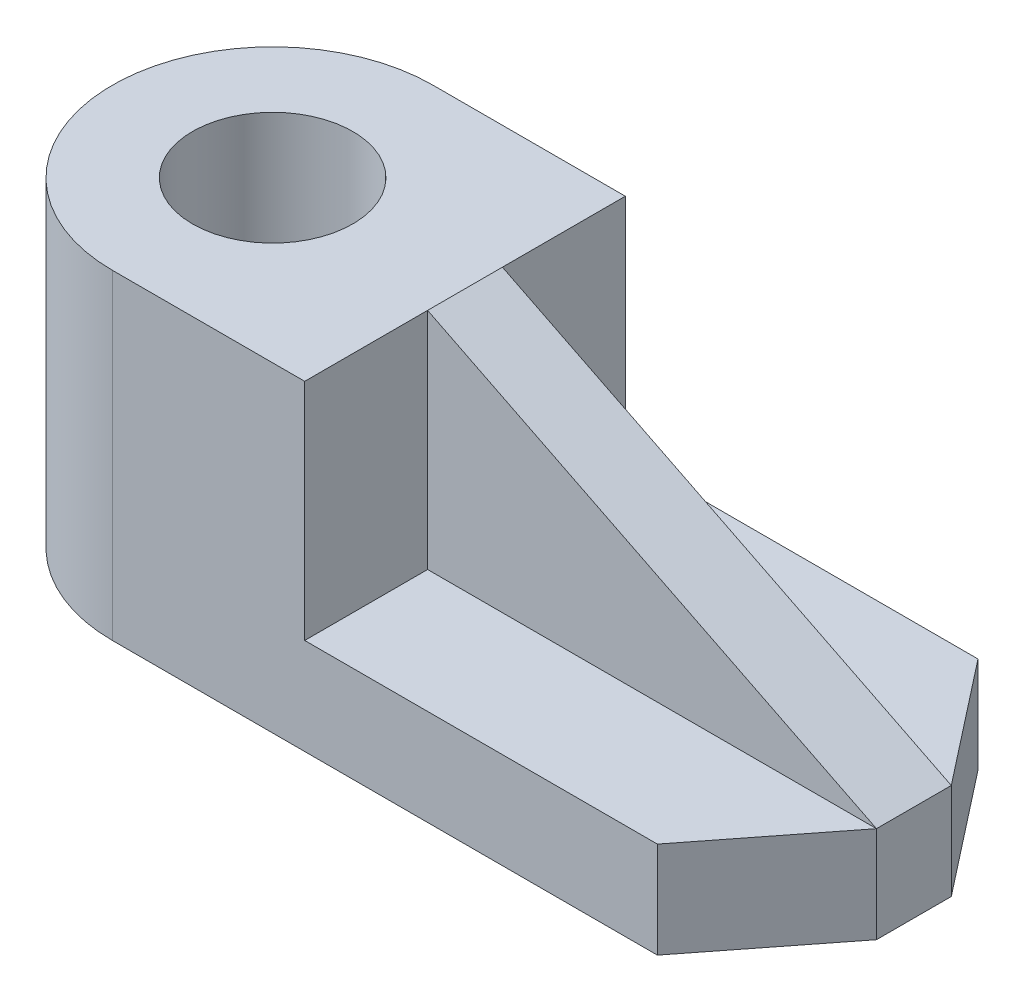
ISO-10303-21;
HEADER;
FILE_DESCRIPTION(('STEP AP214'),'2;1');
FILE_NAME('part.step','',(''),(''),'','','');
FILE_SCHEMA(('AUTOMOTIVE_DESIGN { 1 0 10303 214 1 1 1 1 }'));
ENDSEC;
DATA;
#1=APPLICATION_CONTEXT('core data for automotive mechanical design processes');
#2=APPLICATION_PROTOCOL_DEFINITION('international standard','automotive_design',2000,#1);
#3=PRODUCT_CONTEXT('',#1,'mechanical');
#4=PRODUCT('Part','Part','',(#3));
#5=PRODUCT_RELATED_PRODUCT_CATEGORY('part','',(#4));
#6=PRODUCT_DEFINITION_FORMATION('','',#4);
#7=PRODUCT_DEFINITION_CONTEXT('part definition',#1,'design');
#8=PRODUCT_DEFINITION('design','',#6,#7);
#9=PRODUCT_DEFINITION_SHAPE('','',#8);
#10=(LENGTH_UNIT() NAMED_UNIT(*) SI_UNIT(.MILLI.,.METRE.));
#11=(NAMED_UNIT(*) PLANE_ANGLE_UNIT() SI_UNIT($,.RADIAN.));
#12=(NAMED_UNIT(*) SI_UNIT($,.STERADIAN.) SOLID_ANGLE_UNIT());
#13=UNCERTAINTY_MEASURE_WITH_UNIT(LENGTH_MEASURE(1.E-05),#10,'distance_accuracy_value','');
#14=(GEOMETRIC_REPRESENTATION_CONTEXT(3) GLOBAL_UNCERTAINTY_ASSIGNED_CONTEXT((#13)) GLOBAL_UNIT_ASSIGNED_CONTEXT((#10,
#11,#12)) REPRESENTATION_CONTEXT('',''));
#15=CARTESIAN_POINT('',(0.,0.,0.));
#16=DIRECTION('',(0.,0.,1.));
#17=DIRECTION('',(1.,0.,0.));
#18=AXIS2_PLACEMENT_3D('',#15,#16,#17);
#19=CARTESIAN_POINT('',(18.,30.,-15.));
#20=DIRECTION('',(-1.,0.,0.));
#21=DIRECTION('',(0.,0.,1.));
#22=AXIS2_PLACEMENT_3D('',#19,#20,#21);
#23=PLANE('',#22);
#24=DIRECTION('',(0.,-1.,0.));
#25=VECTOR('',#24,1.);
#26=CARTESIAN_POINT('',(18.,9.,-3.5));
#27=LINE('',#26,#25);
#28=CARTESIAN_POINT('',(18.,30.,-3.5));
#29=VERTEX_POINT('',#28);
#30=CARTESIAN_POINT('',(18.,9.,-3.5));
#31=VERTEX_POINT('',#30);
#32=EDGE_CURVE('E141',#29,#31,#27,.T.);
#33=ORIENTED_EDGE('',*,*,#32,.T.);
#34=DIRECTION('',(0.,0.,1.));
#35=VECTOR('',#34,1.);
#36=CARTESIAN_POINT('',(18.,9.,-15.));
#37=LINE('',#36,#35);
#38=CARTESIAN_POINT('',(18.,9.,-15.));
#39=VERTEX_POINT('',#38);
#40=EDGE_CURVE('E69',#39,#31,#37,.T.);
#41=ORIENTED_EDGE('',*,*,#40,.F.);
#42=DIRECTION('',(0.,-1.,0.));
#43=VECTOR('',#42,1.);
#44=CARTESIAN_POINT('',(18.,30.,-15.));
#45=LINE('',#44,#43);
#46=CARTESIAN_POINT('',(18.,30.,-15.));
#47=VERTEX_POINT('',#46);
#48=EDGE_CURVE('E231',#47,#39,#45,.T.);
#49=ORIENTED_EDGE('',*,*,#48,.F.);
#50=DIRECTION('',(0.,0.,-1.));
#51=VECTOR('',#50,1.);
#52=CARTESIAN_POINT('',(18.,30.,-15.));
#53=LINE('',#52,#51);
#54=EDGE_CURVE('E211',#29,#47,#53,.T.);
#55=ORIENTED_EDGE('',*,*,#54,.F.);
#56=EDGE_LOOP('',(#33,#41,#49,#55));
#57=FACE_BOUND('',#56,.T.);
#58=ADVANCED_FACE('F45',(#57),#23,.F.);
#59=CARTESIAN_POINT('',(0.,9.,0.));
#60=DIRECTION('',(0.,-1.,0.));
#61=DIRECTION('',(0.,0.,-1.));
#62=AXIS2_PLACEMENT_3D('',#59,#60,#61);
#63=PLANE('',#62);
#64=DIRECTION('',(1.,0.,0.));
#65=VECTOR('',#64,1.);
#66=CARTESIAN_POINT('',(60.,9.,-3.5));
#67=LINE('',#66,#65);
#68=CARTESIAN_POINT('',(60.,9.,-3.5));
#69=VERTEX_POINT('',#68);
#70=EDGE_CURVE('E254',#31,#69,#67,.T.);
#71=ORIENTED_EDGE('',*,*,#70,.T.);
#72=DIRECTION('',(-0.616308261658111,0.,-0.787505001007586));
#73=VECTOR('',#72,1.);
#74=CARTESIAN_POINT('',(51.,9.,-15.));
#75=LINE('',#74,#73);
#76=CARTESIAN_POINT('',(51.,9.,-15.));
#77=VERTEX_POINT('',#76);
#78=EDGE_CURVE('E170',#69,#77,#75,.T.);
#79=ORIENTED_EDGE('',*,*,#78,.T.);
#80=DIRECTION('',(-1.,0.,0.));
#81=VECTOR('',#80,1.);
#82=CARTESIAN_POINT('',(18.,9.,-15.));
#83=LINE('',#82,#81);
#84=EDGE_CURVE('E186',#77,#39,#83,.T.);
#85=ORIENTED_EDGE('',*,*,#84,.T.);
#86=ORIENTED_EDGE('',*,*,#40,.T.);
#87=EDGE_LOOP('',(#71,#79,#85,#86));
#88=FACE_BOUND('',#87,.T.);
#89=ADVANCED_FACE('F265',(#88),#63,.F.);
#90=CARTESIAN_POINT('',(18.,9.,3.5));
#91=VERTEX_POINT('',#90);
#92=CARTESIAN_POINT('',(18.,9.,15.));
#93=VERTEX_POINT('',#92);
#94=EDGE_CURVE('E239',#91,#93,#37,.T.);
#95=ORIENTED_EDGE('',*,*,#94,.F.);
#96=DIRECTION('',(0.,-1.,0.));
#97=VECTOR('',#96,1.);
#98=CARTESIAN_POINT('',(18.,9.,3.5));
#99=LINE('',#98,#97);
#100=CARTESIAN_POINT('',(18.,30.,3.5));
#101=VERTEX_POINT('',#100);
#102=EDGE_CURVE('E61',#101,#91,#99,.T.);
#103=ORIENTED_EDGE('',*,*,#102,.F.);
#104=CARTESIAN_POINT('',(18.,30.,15.));
#105=VERTEX_POINT('',#104);
#106=EDGE_CURVE('E212',#105,#101,#53,.T.);
#107=ORIENTED_EDGE('',*,*,#106,.F.);
#108=DIRECTION('',(0.,-1.,0.));
#109=VECTOR('',#108,1.);
#110=CARTESIAN_POINT('',(18.,30.,15.));
#111=LINE('',#110,#109);
#112=EDGE_CURVE('E54',#105,#93,#111,.T.);
#113=ORIENTED_EDGE('',*,*,#112,.T.);
#114=EDGE_LOOP('',(#95,#103,#107,#113));
#115=FACE_BOUND('',#114,.T.);
#116=ADVANCED_FACE('F238',(#115),#23,.F.);
#117=CARTESIAN_POINT('',(0.,30.,0.));
#118=DIRECTION('',(0.,1.,0.));
#119=DIRECTION('',(0.,0.,1.));
#120=AXIS2_PLACEMENT_3D('',#117,#118,#119);
#121=PLANE('',#120);
#122=CARTESIAN_POINT('',(0.,30.,0.));
#123=DIRECTION('',(0.,1.,0.));
#124=DIRECTION('',(0.,0.,1.));
#125=AXIS2_PLACEMENT_3D('',#122,#123,#124);
#126=CIRCLE('',#125,15.);
#127=CARTESIAN_POINT('',(0.,30.,-15.));
#128=VERTEX_POINT('',#127);
#129=CARTESIAN_POINT('',(0.,30.,15.));
#130=VERTEX_POINT('',#129);
#131=EDGE_CURVE('E203',#128,#130,#126,.T.);
#132=ORIENTED_EDGE('',*,*,#131,.T.);
#133=DIRECTION('',(1.,0.,0.));
#134=VECTOR('',#133,1.);
#135=CARTESIAN_POINT('',(18.,30.,15.));
#136=LINE('',#135,#134);
#137=EDGE_CURVE('E207',#130,#105,#136,.T.);
#138=ORIENTED_EDGE('',*,*,#137,.T.);
#139=ORIENTED_EDGE('',*,*,#106,.T.);
#140=DIRECTION('',(0.,0.,1.));
#141=VECTOR('',#140,1.);
#142=CARTESIAN_POINT('',(18.,30.,-3.5));
#143=LINE('',#142,#141);
#144=EDGE_CURVE('E139',#29,#101,#143,.T.);
#145=ORIENTED_EDGE('',*,*,#144,.F.);
#146=ORIENTED_EDGE('',*,*,#54,.T.);
#147=DIRECTION('',(-1.,0.,0.));
#148=VECTOR('',#147,1.);
#149=CARTESIAN_POINT('',(0.,30.,-15.));
#150=LINE('',#149,#148);
#151=EDGE_CURVE('E216',#47,#128,#150,.T.);
#152=ORIENTED_EDGE('',*,*,#151,.T.);
#153=EDGE_LOOP('',(#132,#138,#139,#145,#146,#152));
#154=FACE_BOUND('',#153,.T.);
#155=CARTESIAN_POINT('',(0.,30.,0.));
#156=DIRECTION('',(0.,1.,0.));
#157=DIRECTION('',(0.,0.,1.));
#158=AXIS2_PLACEMENT_3D('',#155,#156,#157);
#159=CIRCLE('',#158,7.5);
#160=CARTESIAN_POINT('',(0.,30.,7.5));
#161=VERTEX_POINT('',#160);
#162=EDGE_CURVE('E195',#161,#161,#159,.T.);
#163=ORIENTED_EDGE('',*,*,#162,.F.);
#164=EDGE_LOOP('',(#163));
#165=FACE_BOUND('',#164,.T.);
#166=ADVANCED_FACE('F274',(#154,#165),#121,.T.);
#167=CARTESIAN_POINT('',(0.,0.,0.));
#168=DIRECTION('',(0.,1.,0.));
#169=DIRECTION('',(0.,0.,1.));
#170=AXIS2_PLACEMENT_3D('',#167,#168,#169);
#171=PLANE('',#170);
#172=CARTESIAN_POINT('',(0.,0.,0.));
#173=DIRECTION('',(0.,1.,0.));
#174=DIRECTION('',(0.,0.,1.));
#175=AXIS2_PLACEMENT_3D('',#172,#173,#174);
#176=CIRCLE('',#175,15.);
#177=CARTESIAN_POINT('',(0.,0.,-15.));
#178=VERTEX_POINT('',#177);
#179=CARTESIAN_POINT('',(0.,0.,15.));
#180=VERTEX_POINT('',#179);
#181=EDGE_CURVE('E199',#178,#180,#176,.T.);
#182=ORIENTED_EDGE('',*,*,#181,.F.);
#183=DIRECTION('',(-1.,0.,0.));
#184=VECTOR('',#183,1.);
#185=CARTESIAN_POINT('',(0.,0.,-15.));
#186=LINE('',#185,#184);
#187=CARTESIAN_POINT('',(51.,0.,-15.));
#188=VERTEX_POINT('',#187);
#189=EDGE_CURVE('E208',#188,#178,#186,.T.);
#190=ORIENTED_EDGE('',*,*,#189,.F.);
#191=DIRECTION('',(-0.616308261658111,0.,-0.787505001007586));
#192=VECTOR('',#191,1.);
#193=CARTESIAN_POINT('',(51.,0.,-15.));
#194=LINE('',#193,#192);
#195=CARTESIAN_POINT('',(60.,0.,-3.5));
#196=VERTEX_POINT('',#195);
#197=EDGE_CURVE('E182',#196,#188,#194,.T.);
#198=ORIENTED_EDGE('',*,*,#197,.F.);
#199=DIRECTION('',(0.,0.,-1.));
#200=VECTOR('',#199,1.);
#201=CARTESIAN_POINT('',(60.,0.,-3.5));
#202=LINE('',#201,#200);
#203=CARTESIAN_POINT('',(60.,0.,3.5));
#204=VERTEX_POINT('',#203);
#205=EDGE_CURVE('E179',#204,#196,#202,.T.);
#206=ORIENTED_EDGE('',*,*,#205,.F.);
#207=DIRECTION('',(0.616308261658111,0.,-0.787505001007586));
#208=VECTOR('',#207,1.);
#209=CARTESIAN_POINT('',(60.,0.,3.5));
#210=LINE('',#209,#208);
#211=CARTESIAN_POINT('',(51.,0.,15.));
#212=VERTEX_POINT('',#211);
#213=EDGE_CURVE('E158',#212,#204,#210,.T.);
#214=ORIENTED_EDGE('',*,*,#213,.F.);
#215=DIRECTION('',(1.,0.,0.));
#216=VECTOR('',#215,1.);
#217=CARTESIAN_POINT('',(18.,0.,15.));
#218=LINE('',#217,#216);
#219=EDGE_CURVE('E223',#180,#212,#218,.T.);
#220=ORIENTED_EDGE('',*,*,#219,.F.);
#221=EDGE_LOOP('',(#182,#190,#198,#206,#214,#220));
#222=FACE_BOUND('',#221,.T.);
#223=CARTESIAN_POINT('',(0.,0.,0.));
#224=DIRECTION('',(0.,1.,0.));
#225=DIRECTION('',(0.,0.,1.));
#226=AXIS2_PLACEMENT_3D('',#223,#224,#225);
#227=CIRCLE('',#226,7.5);
#228=CARTESIAN_POINT('',(0.,0.,7.5));
#229=VERTEX_POINT('',#228);
#230=EDGE_CURVE('E194',#229,#229,#227,.T.);
#231=ORIENTED_EDGE('',*,*,#230,.T.);
#232=EDGE_LOOP('',(#231));
#233=FACE_BOUND('',#232,.T.);
#234=ADVANCED_FACE('F281',(#222,#233),#171,.F.);
#235=CARTESIAN_POINT('',(0.,30.,0.));
#236=DIRECTION('',(0.,-1.,0.));
#237=DIRECTION('',(0.,0.,-1.));
#238=AXIS2_PLACEMENT_3D('',#235,#236,#237);
#239=CYLINDRICAL_SURFACE('',#238,15.);
#240=ORIENTED_EDGE('',*,*,#181,.T.);
#241=DIRECTION('',(0.,-1.,0.));
#242=VECTOR('',#241,1.);
#243=CARTESIAN_POINT('',(0.,30.,15.));
#244=LINE('',#243,#242);
#245=EDGE_CURVE('E11',#130,#180,#244,.T.);
#246=ORIENTED_EDGE('',*,*,#245,.F.);
#247=ORIENTED_EDGE('',*,*,#131,.F.);
#248=DIRECTION('',(0.,-1.,0.));
#249=VECTOR('',#248,1.);
#250=CARTESIAN_POINT('',(0.,30.,-15.));
#251=LINE('',#250,#249);
#252=EDGE_CURVE('E219',#128,#178,#251,.T.);
#253=ORIENTED_EDGE('',*,*,#252,.T.);
#254=EDGE_LOOP('',(#240,#246,#247,#253));
#255=FACE_BOUND('',#254,.T.);
#256=ADVANCED_FACE('F47',(#255),#239,.T.);
#257=CARTESIAN_POINT('',(18.,30.,15.));
#258=DIRECTION('',(0.,0.,-1.));
#259=DIRECTION('',(-1.,0.,0.));
#260=AXIS2_PLACEMENT_3D('',#257,#258,#259);
#261=PLANE('',#260);
#262=ORIENTED_EDGE('',*,*,#219,.T.);
#263=DIRECTION('',(0.,-1.,0.));
#264=VECTOR('',#263,1.);
#265=CARTESIAN_POINT('',(51.,9.,15.));
#266=LINE('',#265,#264);
#267=CARTESIAN_POINT('',(51.,9.,15.));
#268=VERTEX_POINT('',#267);
#269=EDGE_CURVE('E162',#268,#212,#266,.T.);
#270=ORIENTED_EDGE('',*,*,#269,.F.);
#271=DIRECTION('',(1.,0.,0.));
#272=VECTOR('',#271,1.);
#273=CARTESIAN_POINT('',(51.,9.,15.));
#274=LINE('',#273,#272);
#275=EDGE_CURVE('E148',#93,#268,#274,.T.);
#276=ORIENTED_EDGE('',*,*,#275,.F.);
#277=ORIENTED_EDGE('',*,*,#112,.F.);
#278=ORIENTED_EDGE('',*,*,#137,.F.);
#279=ORIENTED_EDGE('',*,*,#245,.T.);
#280=EDGE_LOOP('',(#262,#270,#276,#277,#278,#279));
#281=FACE_BOUND('',#280,.T.);
#282=ADVANCED_FACE('F241',(#281),#261,.F.);
#283=CARTESIAN_POINT('',(0.,30.,-15.));
#284=DIRECTION('',(0.,0.,1.));
#285=DIRECTION('',(1.,0.,0.));
#286=AXIS2_PLACEMENT_3D('',#283,#284,#285);
#287=PLANE('',#286);
#288=ORIENTED_EDGE('',*,*,#189,.T.);
#289=ORIENTED_EDGE('',*,*,#252,.F.);
#290=ORIENTED_EDGE('',*,*,#151,.F.);
#291=ORIENTED_EDGE('',*,*,#48,.T.);
#292=ORIENTED_EDGE('',*,*,#84,.F.);
#293=DIRECTION('',(0.,-1.,0.));
#294=VECTOR('',#293,1.);
#295=CARTESIAN_POINT('',(51.,9.,-15.));
#296=LINE('',#295,#294);
#297=EDGE_CURVE('E173',#77,#188,#296,.T.);
#298=ORIENTED_EDGE('',*,*,#297,.T.);
#299=EDGE_LOOP('',(#288,#289,#290,#291,#292,#298));
#300=FACE_BOUND('',#299,.T.);
#301=ADVANCED_FACE('F269',(#300),#287,.F.);
#302=CARTESIAN_POINT('',(0.,30.,0.));
#303=DIRECTION('',(0.,-1.,0.));
#304=DIRECTION('',(0.,0.,-1.));
#305=AXIS2_PLACEMENT_3D('',#302,#303,#304);
#306=CYLINDRICAL_SURFACE('',#305,7.5);
#307=ORIENTED_EDGE('',*,*,#162,.T.);
#308=EDGE_LOOP('',(#307));
#309=FACE_BOUND('',#308,.T.);
#310=ORIENTED_EDGE('',*,*,#230,.F.);
#311=EDGE_LOOP('',(#310));
#312=FACE_BOUND('',#311,.T.);
#313=ADVANCED_FACE('F312',(#309,#312),#306,.F.);
#314=CARTESIAN_POINT('',(60.,9.,3.5));
#315=DIRECTION('',(-0.787505001007586,0.,-0.616308261658111));
#316=DIRECTION('',(-0.616308261658111,0.,0.787505001007586));
#317=AXIS2_PLACEMENT_3D('',#314,#315,#316);
#318=PLANE('',#317);
#319=ORIENTED_EDGE('',*,*,#213,.T.);
#320=DIRECTION('',(0.,-1.,0.));
#321=VECTOR('',#320,1.);
#322=CARTESIAN_POINT('',(60.,9.,3.5));
#323=LINE('',#322,#321);
#324=CARTESIAN_POINT('',(60.,9.,3.5));
#325=VERTEX_POINT('',#324);
#326=EDGE_CURVE('E155',#325,#204,#323,.T.);
#327=ORIENTED_EDGE('',*,*,#326,.F.);
#328=DIRECTION('',(0.616308261658111,0.,-0.787505001007586));
#329=VECTOR('',#328,1.);
#330=CARTESIAN_POINT('',(60.,9.,3.5));
#331=LINE('',#330,#329);
#332=EDGE_CURVE('E144',#268,#325,#331,.T.);
#333=ORIENTED_EDGE('',*,*,#332,.F.);
#334=ORIENTED_EDGE('',*,*,#269,.T.);
#335=EDGE_LOOP('',(#319,#327,#333,#334));
#336=FACE_BOUND('',#335,.T.);
#337=ADVANCED_FACE('F156',(#336),#318,.F.);
#338=CARTESIAN_POINT('',(60.,9.,-3.5));
#339=DIRECTION('',(-1.,0.,0.));
#340=DIRECTION('',(0.,0.,1.));
#341=AXIS2_PLACEMENT_3D('',#338,#339,#340);
#342=PLANE('',#341);
#343=ORIENTED_EDGE('',*,*,#205,.T.);
#344=DIRECTION('',(0.,-1.,0.));
#345=VECTOR('',#344,1.);
#346=CARTESIAN_POINT('',(60.,9.,-3.5));
#347=LINE('',#346,#345);
#348=EDGE_CURVE('E163',#69,#196,#347,.T.);
#349=ORIENTED_EDGE('',*,*,#348,.F.);
#350=DIRECTION('',(0.,0.,-1.));
#351=VECTOR('',#350,1.);
#352=CARTESIAN_POINT('',(60.,9.,-3.5));
#353=LINE('',#352,#351);
#354=EDGE_CURVE('E136',#325,#69,#353,.T.);
#355=ORIENTED_EDGE('',*,*,#354,.F.);
#356=ORIENTED_EDGE('',*,*,#326,.T.);
#357=EDGE_LOOP('',(#343,#349,#355,#356));
#358=FACE_BOUND('',#357,.T.);
#359=ADVANCED_FACE('F166',(#358),#342,.F.);
#360=CARTESIAN_POINT('',(51.,9.,-15.));
#361=DIRECTION('',(-0.787505001007586,0.,0.616308261658111));
#362=DIRECTION('',(0.616308261658111,0.,0.787505001007586));
#363=AXIS2_PLACEMENT_3D('',#360,#361,#362);
#364=PLANE('',#363);
#365=ORIENTED_EDGE('',*,*,#197,.T.);
#366=ORIENTED_EDGE('',*,*,#297,.F.);
#367=ORIENTED_EDGE('',*,*,#78,.F.);
#368=ORIENTED_EDGE('',*,*,#348,.T.);
#369=EDGE_LOOP('',(#365,#366,#367,#368));
#370=FACE_BOUND('',#369,.T.);
#371=ADVANCED_FACE('F285',(#370),#364,.F.);
#372=ORIENTED_EDGE('',*,*,#332,.T.);
#373=DIRECTION('',(1.,0.,0.));
#374=VECTOR('',#373,1.);
#375=CARTESIAN_POINT('',(60.,9.,3.5));
#376=LINE('',#375,#374);
#377=EDGE_CURVE('E123',#91,#325,#376,.T.);
#378=ORIENTED_EDGE('',*,*,#377,.F.);
#379=ORIENTED_EDGE('',*,*,#94,.T.);
#380=ORIENTED_EDGE('',*,*,#275,.T.);
#381=EDGE_LOOP('',(#372,#378,#379,#380));
#382=FACE_BOUND('',#381,.T.);
#383=ADVANCED_FACE('F146',(#382),#63,.F.);
#384=CARTESIAN_POINT('',(18.,30.,-3.5));
#385=DIRECTION('',(0.447213595499958,0.894427190999916,0.));
#386=DIRECTION('',(-0.894427190999916,0.447213595499958,0.));
#387=AXIS2_PLACEMENT_3D('',#384,#385,#386);
#388=PLANE('',#387);
#389=ORIENTED_EDGE('',*,*,#144,.T.);
#390=DIRECTION('',(-0.894427190999916,0.447213595499958,0.));
#391=VECTOR('',#390,1.);
#392=CARTESIAN_POINT('',(18.,30.,3.5));
#393=LINE('',#392,#391);
#394=EDGE_CURVE('E126',#325,#101,#393,.T.);
#395=ORIENTED_EDGE('',*,*,#394,.F.);
#396=ORIENTED_EDGE('',*,*,#354,.T.);
#397=DIRECTION('',(-0.894427190999916,0.447213595499958,0.));
#398=VECTOR('',#397,1.);
#399=CARTESIAN_POINT('',(18.,30.,-3.5));
#400=LINE('',#399,#398);
#401=EDGE_CURVE('E251',#69,#29,#400,.T.);
#402=ORIENTED_EDGE('',*,*,#401,.T.);
#403=EDGE_LOOP('',(#389,#395,#396,#402));
#404=FACE_BOUND('',#403,.T.);
#405=ADVANCED_FACE('F133',(#404),#388,.T.);
#406=CARTESIAN_POINT('',(0.,0.,-3.5));
#407=DIRECTION('',(0.,0.,1.));
#408=DIRECTION('',(1.,0.,0.));
#409=AXIS2_PLACEMENT_3D('',#406,#407,#408);
#410=PLANE('',#409);
#411=ORIENTED_EDGE('',*,*,#32,.F.);
#412=ORIENTED_EDGE('',*,*,#401,.F.);
#413=ORIENTED_EDGE('',*,*,#70,.F.);
#414=EDGE_LOOP('',(#411,#412,#413));
#415=FACE_BOUND('',#414,.T.);
#416=ADVANCED_FACE('F393',(#415),#410,.F.);
#417=CARTESIAN_POINT('',(0.,0.,3.5));
#418=DIRECTION('',(0.,0.,1.));
#419=DIRECTION('',(1.,0.,0.));
#420=AXIS2_PLACEMENT_3D('',#417,#418,#419);
#421=PLANE('',#420);
#422=ORIENTED_EDGE('',*,*,#102,.T.);
#423=ORIENTED_EDGE('',*,*,#377,.T.);
#424=ORIENTED_EDGE('',*,*,#394,.T.);
#425=EDGE_LOOP('',(#422,#423,#424));
#426=FACE_BOUND('',#425,.T.);
#427=ADVANCED_FACE('F125',(#426),#421,.T.);
#428=CLOSED_SHELL('',(#58,#89,#116,#166,#234,#256,#282,#301,#313,#337,#359,#371,#383,#405,#416,#427));
#429=MANIFOLD_SOLID_BREP('B2',#428);
#430=ADVANCED_BREP_SHAPE_REPRESENTATION('',(#18,#429),#14);
#431=SHAPE_DEFINITION_REPRESENTATION(#9,#430);
ENDSEC;
END-ISO-10303-21;
